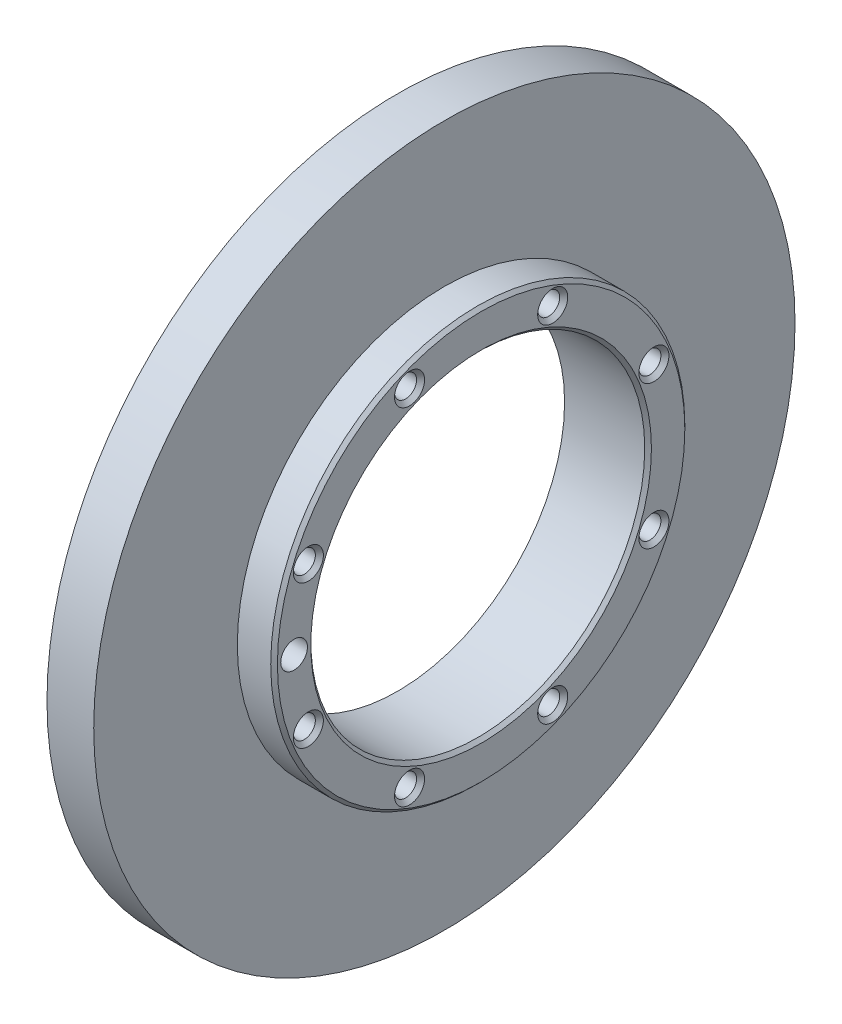
ISO-10303-21;
HEADER;
FILE_DESCRIPTION(('STEP AP214'),'2;1');
FILE_NAME('part.step','',(''),(''),'','','');
FILE_SCHEMA(('AUTOMOTIVE_DESIGN { 1 0 10303 214 1 1 1 1 }'));
ENDSEC;
DATA;
#1=APPLICATION_CONTEXT('core data for automotive mechanical design processes');
#2=APPLICATION_PROTOCOL_DEFINITION('international standard','automotive_design',2000,#1);
#3=PRODUCT_CONTEXT('',#1,'mechanical');
#4=PRODUCT('Part','Part','',(#3));
#5=PRODUCT_RELATED_PRODUCT_CATEGORY('part','',(#4));
#6=PRODUCT_DEFINITION_FORMATION('','',#4);
#7=PRODUCT_DEFINITION_CONTEXT('part definition',#1,'design');
#8=PRODUCT_DEFINITION('design','',#6,#7);
#9=PRODUCT_DEFINITION_SHAPE('','',#8);
#10=(LENGTH_UNIT() NAMED_UNIT(*) SI_UNIT(.MILLI.,.METRE.));
#11=(NAMED_UNIT(*) PLANE_ANGLE_UNIT() SI_UNIT($,.RADIAN.));
#12=(NAMED_UNIT(*) SI_UNIT($,.STERADIAN.) SOLID_ANGLE_UNIT());
#13=UNCERTAINTY_MEASURE_WITH_UNIT(LENGTH_MEASURE(1.E-05),#10,'distance_accuracy_value','');
#14=(GEOMETRIC_REPRESENTATION_CONTEXT(3) GLOBAL_UNCERTAINTY_ASSIGNED_CONTEXT((#13)) GLOBAL_UNIT_ASSIGNED_CONTEXT((#10,
#11,#12)) REPRESENTATION_CONTEXT('',''));
#15=CARTESIAN_POINT('',(0.,0.,0.));
#16=DIRECTION('',(0.,0.,1.));
#17=DIRECTION('',(1.,0.,0.));
#18=AXIS2_PLACEMENT_3D('',#15,#16,#17);
#19=CARTESIAN_POINT('',(889.5,-0.5,1264.));
#20=DIRECTION('',(-1.,0.,0.));
#21=DIRECTION('',(0.,0.,1.));
#22=AXIS2_PLACEMENT_3D('',#19,#20,#21);
#23=PLANE('',#22);
#24=CARTESIAN_POINT('',(889.5,-11.21513610622,1289.86862691));
#25=DIRECTION('',(1.,0.,0.));
#26=DIRECTION('',(0.,0.,-1.));
#27=AXIS2_PLACEMENT_3D('',#24,#25,#26);
#28=CIRCLE('',#27,1.65);
#29=CARTESIAN_POINT('',(889.5,-11.21513610622,1288.21862691));
#30=VERTEX_POINT('',#29);
#31=EDGE_CURVE('E18',#30,#30,#28,.T.);
#32=ORIENTED_EDGE('',*,*,#31,.T.);
#33=EDGE_LOOP('',(#32));
#34=FACE_BOUND('',#33,.T.);
#35=ADVANCED_FACE('F15',(#34),#23,.F.);
#36=CARTESIAN_POINT('',(889.5,-0.5,1264.));
#37=DIRECTION('',(-1.,0.,0.));
#38=DIRECTION('',(0.,0.,1.));
#39=AXIS2_PLACEMENT_3D('',#36,#37,#38);
#40=PLANE('',#39);
#41=CARTESIAN_POINT('',(889.5,-26.36862691032,1274.715136106));
#42=DIRECTION('',(1.,0.,0.));
#43=DIRECTION('',(0.,0.,-1.));
#44=AXIS2_PLACEMENT_3D('',#41,#42,#43);
#45=CIRCLE('',#44,1.65);
#46=CARTESIAN_POINT('',(889.5,-26.36862691032,1273.065136106));
#47=VERTEX_POINT('',#46);
#48=EDGE_CURVE('E94',#47,#47,#45,.T.);
#49=ORIENTED_EDGE('',*,*,#48,.T.);
#50=EDGE_LOOP('',(#49));
#51=FACE_BOUND('',#50,.T.);
#52=ADVANCED_FACE('F228',(#51),#40,.F.);
#53=CARTESIAN_POINT('',(889.5,-0.5,1264.));
#54=DIRECTION('',(-1.,0.,0.));
#55=DIRECTION('',(0.,0.,1.));
#56=AXIS2_PLACEMENT_3D('',#53,#54,#55);
#57=PLANE('',#56);
#58=CARTESIAN_POINT('',(889.5,-26.36862691032,1253.284863894));
#59=DIRECTION('',(1.,0.,0.));
#60=DIRECTION('',(0.,0.,-1.));
#61=AXIS2_PLACEMENT_3D('',#58,#59,#60);
#62=CIRCLE('',#61,1.65);
#63=CARTESIAN_POINT('',(889.5,-26.36862691032,1251.634863894));
#64=VERTEX_POINT('',#63);
#65=EDGE_CURVE('E92',#64,#64,#62,.T.);
#66=ORIENTED_EDGE('',*,*,#65,.T.);
#67=EDGE_LOOP('',(#66));
#68=FACE_BOUND('',#67,.T.);
#69=ADVANCED_FACE('F225',(#68),#57,.F.);
#70=CARTESIAN_POINT('',(889.5,-0.5,1264.));
#71=DIRECTION('',(-1.,0.,0.));
#72=DIRECTION('',(0.,0.,1.));
#73=AXIS2_PLACEMENT_3D('',#70,#71,#72);
#74=PLANE('',#73);
#75=CARTESIAN_POINT('',(889.5,-11.21513610622,1238.13137309));
#76=DIRECTION('',(1.,0.,0.));
#77=DIRECTION('',(0.,0.,-1.));
#78=AXIS2_PLACEMENT_3D('',#75,#76,#77);
#79=CIRCLE('',#78,1.65);
#80=CARTESIAN_POINT('',(889.5,-11.21513610622,1236.48137309));
#81=VERTEX_POINT('',#80);
#82=EDGE_CURVE('E89',#81,#81,#79,.T.);
#83=ORIENTED_EDGE('',*,*,#82,.T.);
#84=EDGE_LOOP('',(#83));
#85=FACE_BOUND('',#84,.T.);
#86=ADVANCED_FACE('F227',(#85),#74,.F.);
#87=CARTESIAN_POINT('',(889.5,-0.5,1264.));
#88=DIRECTION('',(-1.,0.,0.));
#89=DIRECTION('',(0.,0.,1.));
#90=AXIS2_PLACEMENT_3D('',#87,#88,#89);
#91=PLANE('',#90);
#92=CARTESIAN_POINT('',(889.5,10.21513610622,1238.13137309));
#93=DIRECTION('',(1.,0.,0.));
#94=DIRECTION('',(0.,0.,-1.));
#95=AXIS2_PLACEMENT_3D('',#92,#93,#94);
#96=CIRCLE('',#95,1.65);
#97=CARTESIAN_POINT('',(889.5,10.21513610622,1236.48137309));
#98=VERTEX_POINT('',#97);
#99=EDGE_CURVE('E86',#98,#98,#96,.T.);
#100=ORIENTED_EDGE('',*,*,#99,.T.);
#101=EDGE_LOOP('',(#100));
#102=FACE_BOUND('',#101,.T.);
#103=ADVANCED_FACE('F234',(#102),#91,.F.);
#104=CARTESIAN_POINT('',(889.5,-0.5,1264.));
#105=DIRECTION('',(-1.,0.,0.));
#106=DIRECTION('',(0.,0.,1.));
#107=AXIS2_PLACEMENT_3D('',#104,#105,#106);
#108=PLANE('',#107);
#109=CARTESIAN_POINT('',(889.5,25.36862691032,1253.284863894));
#110=DIRECTION('',(1.,0.,0.));
#111=DIRECTION('',(0.,0.,-1.));
#112=AXIS2_PLACEMENT_3D('',#109,#110,#111);
#113=CIRCLE('',#112,1.65);
#114=CARTESIAN_POINT('',(889.5,25.36862691032,1251.634863894));
#115=VERTEX_POINT('',#114);
#116=EDGE_CURVE('E83',#115,#115,#113,.T.);
#117=ORIENTED_EDGE('',*,*,#116,.T.);
#118=EDGE_LOOP('',(#117));
#119=FACE_BOUND('',#118,.T.);
#120=ADVANCED_FACE('F240',(#119),#108,.F.);
#121=CARTESIAN_POINT('',(889.5,-0.5,1264.));
#122=DIRECTION('',(-1.,0.,0.));
#123=DIRECTION('',(0.,0.,1.));
#124=AXIS2_PLACEMENT_3D('',#121,#122,#123);
#125=PLANE('',#124);
#126=CARTESIAN_POINT('',(889.5,25.36862691032,1274.715136106));
#127=DIRECTION('',(1.,0.,0.));
#128=DIRECTION('',(0.,0.,-1.));
#129=AXIS2_PLACEMENT_3D('',#126,#127,#128);
#130=CIRCLE('',#129,1.65);
#131=CARTESIAN_POINT('',(889.5,25.36862691032,1273.065136106));
#132=VERTEX_POINT('',#131);
#133=EDGE_CURVE('E80',#132,#132,#130,.T.);
#134=ORIENTED_EDGE('',*,*,#133,.T.);
#135=EDGE_LOOP('',(#134));
#136=FACE_BOUND('',#135,.T.);
#137=ADVANCED_FACE('F116',(#136),#125,.F.);
#138=CARTESIAN_POINT('',(889.5,-0.5,1264.));
#139=DIRECTION('',(-1.,0.,0.));
#140=DIRECTION('',(0.,0.,1.));
#141=AXIS2_PLACEMENT_3D('',#138,#139,#140);
#142=PLANE('',#141);
#143=CARTESIAN_POINT('',(889.5,10.21513610622,1289.86862691));
#144=DIRECTION('',(1.,0.,0.));
#145=DIRECTION('',(0.,0.,-1.));
#146=AXIS2_PLACEMENT_3D('',#143,#144,#145);
#147=CIRCLE('',#146,1.65);
#148=CARTESIAN_POINT('',(889.5,10.21513610622,1288.21862691));
#149=VERTEX_POINT('',#148);
#150=EDGE_CURVE('E77',#149,#149,#147,.T.);
#151=ORIENTED_EDGE('',*,*,#150,.T.);
#152=EDGE_LOOP('',(#151));
#153=FACE_BOUND('',#152,.T.);
#154=ADVANCED_FACE('F105',(#153),#142,.F.);
#155=CARTESIAN_POINT('',(881.3590089775,-11.21513610622,1289.86862691));
#156=DIRECTION('',(1.,0.,0.));
#157=DIRECTION('',(0.,0.,-1.));
#158=AXIS2_PLACEMENT_3D('',#155,#156,#157);
#159=CYLINDRICAL_SURFACE('',#158,1.65);
#160=CARTESIAN_POINT('',(894.399999999735,-11.21513610622,1289.86862691));
#161=DIRECTION('',(1.,0.,0.));
#162=DIRECTION('',(0.,0.,1.));
#163=AXIS2_PLACEMENT_3D('',#160,#161,#162);
#164=CIRCLE('',#163,1.65000000026039);
#165=CARTESIAN_POINT('',(894.399999999735,-11.21513610622,1291.51862691026));
#166=VERTEX_POINT('',#165);
#167=EDGE_CURVE('E30',#166,#166,#164,.T.);
#168=ORIENTED_EDGE('',*,*,#167,.T.);
#169=EDGE_LOOP('',(#168));
#170=FACE_BOUND('',#169,.T.);
#171=ORIENTED_EDGE('',*,*,#31,.F.);
#172=EDGE_LOOP('',(#171));
#173=FACE_BOUND('',#172,.T.);
#174=ADVANCED_FACE('F102',(#170,#173),#159,.F.);
#175=CARTESIAN_POINT('',(881.3590089775,-26.36862691032,1274.715136106));
#176=DIRECTION('',(1.,0.,0.));
#177=DIRECTION('',(0.,0.,-1.));
#178=AXIS2_PLACEMENT_3D('',#175,#176,#177);
#179=CYLINDRICAL_SURFACE('',#178,1.65);
#180=CARTESIAN_POINT('',(894.399999999735,-26.36862691032,1274.715136106));
#181=DIRECTION('',(1.,0.,0.));
#182=DIRECTION('',(0.,0.,1.));
#183=AXIS2_PLACEMENT_3D('',#180,#181,#182);
#184=CIRCLE('',#183,1.65000000027837);
#185=CARTESIAN_POINT('',(894.399999999735,-26.36862691032,1276.36513610628));
#186=VERTEX_POINT('',#185);
#187=EDGE_CURVE('E460',#186,#186,#184,.T.);
#188=ORIENTED_EDGE('',*,*,#187,.T.);
#189=EDGE_LOOP('',(#188));
#190=FACE_BOUND('',#189,.T.);
#191=ORIENTED_EDGE('',*,*,#48,.F.);
#192=EDGE_LOOP('',(#191));
#193=FACE_BOUND('',#192,.T.);
#194=ADVANCED_FACE('F104',(#190,#193),#179,.F.);
#195=CARTESIAN_POINT('',(881.3590089775,-26.36862691032,1253.284863894));
#196=DIRECTION('',(1.,0.,0.));
#197=DIRECTION('',(0.,0.,-1.));
#198=AXIS2_PLACEMENT_3D('',#195,#196,#197);
#199=CYLINDRICAL_SURFACE('',#198,1.65);
#200=CARTESIAN_POINT('',(894.399999999735,-26.36862691032,1253.284863894));
#201=DIRECTION('',(1.,0.,0.));
#202=DIRECTION('',(0.,0.,1.));
#203=AXIS2_PLACEMENT_3D('',#200,#201,#202);
#204=CIRCLE('',#203,1.65000000022064);
#205=CARTESIAN_POINT('',(894.399999999735,-26.36862691032,1254.93486389422));
#206=VERTEX_POINT('',#205);
#207=EDGE_CURVE('E222',#206,#206,#204,.T.);
#208=ORIENTED_EDGE('',*,*,#207,.T.);
#209=EDGE_LOOP('',(#208));
#210=FACE_BOUND('',#209,.T.);
#211=ORIENTED_EDGE('',*,*,#65,.F.);
#212=EDGE_LOOP('',(#211));
#213=FACE_BOUND('',#212,.T.);
#214=ADVANCED_FACE('F113',(#210,#213),#199,.F.);
#215=CARTESIAN_POINT('',(881.3590089775,-11.21513610622,1238.13137309));
#216=DIRECTION('',(1.,0.,0.));
#217=DIRECTION('',(0.,0.,-1.));
#218=AXIS2_PLACEMENT_3D('',#215,#216,#217);
#219=CYLINDRICAL_SURFACE('',#218,1.65);
#220=CARTESIAN_POINT('',(894.399999999735,-11.21513610622,1238.13137309));
#221=DIRECTION('',(1.,0.,0.));
#222=DIRECTION('',(0.,0.,1.));
#223=AXIS2_PLACEMENT_3D('',#220,#221,#222);
#224=CIRCLE('',#223,1.65000000029547);
#225=CARTESIAN_POINT('',(894.399999999735,-11.21513610622,1239.7813730903));
#226=VERTEX_POINT('',#225);
#227=EDGE_CURVE('E459',#226,#226,#224,.T.);
#228=ORIENTED_EDGE('',*,*,#227,.T.);
#229=EDGE_LOOP('',(#228));
#230=FACE_BOUND('',#229,.T.);
#231=ORIENTED_EDGE('',*,*,#82,.F.);
#232=EDGE_LOOP('',(#231));
#233=FACE_BOUND('',#232,.T.);
#234=ADVANCED_FACE('F210',(#230,#233),#219,.F.);
#235=CARTESIAN_POINT('',(881.3590089775,10.21513610622,1238.13137309));
#236=DIRECTION('',(1.,0.,0.));
#237=DIRECTION('',(0.,0.,-1.));
#238=AXIS2_PLACEMENT_3D('',#235,#236,#237);
#239=CYLINDRICAL_SURFACE('',#238,1.65);
#240=CARTESIAN_POINT('',(894.399999999735,10.21513610622,1238.13137309));
#241=DIRECTION('',(1.,0.,0.));
#242=DIRECTION('',(0.,0.,1.));
#243=AXIS2_PLACEMENT_3D('',#240,#241,#242);
#244=CIRCLE('',#243,1.65000000029547);
#245=CARTESIAN_POINT('',(894.399999999735,10.21513610622,1239.7813730903));
#246=VERTEX_POINT('',#245);
#247=EDGE_CURVE('E463',#246,#246,#244,.T.);
#248=ORIENTED_EDGE('',*,*,#247,.T.);
#249=EDGE_LOOP('',(#248));
#250=FACE_BOUND('',#249,.T.);
#251=ORIENTED_EDGE('',*,*,#99,.F.);
#252=EDGE_LOOP('',(#251));
#253=FACE_BOUND('',#252,.T.);
#254=ADVANCED_FACE('F206',(#250,#253),#239,.F.);
#255=CARTESIAN_POINT('',(881.3590089775,25.36862691032,1253.284863894));
#256=DIRECTION('',(1.,0.,0.));
#257=DIRECTION('',(0.,0.,-1.));
#258=AXIS2_PLACEMENT_3D('',#255,#256,#257);
#259=CYLINDRICAL_SURFACE('',#258,1.65);
#260=CARTESIAN_POINT('',(894.399999999735,25.36862691032,1253.284863894));
#261=DIRECTION('',(1.,0.,0.));
#262=DIRECTION('',(0.,0.,1.));
#263=AXIS2_PLACEMENT_3D('',#260,#261,#262);
#264=CIRCLE('',#263,1.65000000022064);
#265=CARTESIAN_POINT('',(894.399999999735,25.36862691032,1254.93486389422));
#266=VERTEX_POINT('',#265);
#267=EDGE_CURVE('E469',#266,#266,#264,.T.);
#268=ORIENTED_EDGE('',*,*,#267,.T.);
#269=EDGE_LOOP('',(#268));
#270=FACE_BOUND('',#269,.T.);
#271=ORIENTED_EDGE('',*,*,#116,.F.);
#272=EDGE_LOOP('',(#271));
#273=FACE_BOUND('',#272,.T.);
#274=ADVANCED_FACE('F202',(#270,#273),#259,.F.);
#275=CARTESIAN_POINT('',(881.3590089775,25.36862691032,1274.715136106));
#276=DIRECTION('',(1.,0.,0.));
#277=DIRECTION('',(0.,0.,-1.));
#278=AXIS2_PLACEMENT_3D('',#275,#276,#277);
#279=CYLINDRICAL_SURFACE('',#278,1.65);
#280=CARTESIAN_POINT('',(894.399999999735,25.36862691032,1274.715136106));
#281=DIRECTION('',(1.,0.,0.));
#282=DIRECTION('',(0.,0.,1.));
#283=AXIS2_PLACEMENT_3D('',#280,#281,#282);
#284=CIRCLE('',#283,1.65000000027837);
#285=CARTESIAN_POINT('',(894.399999999735,25.36862691032,1276.36513610628));
#286=VERTEX_POINT('',#285);
#287=EDGE_CURVE('E472',#286,#286,#284,.T.);
#288=ORIENTED_EDGE('',*,*,#287,.T.);
#289=EDGE_LOOP('',(#288));
#290=FACE_BOUND('',#289,.T.);
#291=ORIENTED_EDGE('',*,*,#133,.F.);
#292=EDGE_LOOP('',(#291));
#293=FACE_BOUND('',#292,.T.);
#294=ADVANCED_FACE('F198',(#290,#293),#279,.F.);
#295=CARTESIAN_POINT('',(881.3590089775,10.21513610622,1289.86862691));
#296=DIRECTION('',(1.,0.,0.));
#297=DIRECTION('',(0.,0.,-1.));
#298=AXIS2_PLACEMENT_3D('',#295,#296,#297);
#299=CYLINDRICAL_SURFACE('',#298,1.65);
#300=CARTESIAN_POINT('',(894.399999999735,10.21513610622,1289.86862691));
#301=DIRECTION('',(1.,0.,0.));
#302=DIRECTION('',(0.,0.,1.));
#303=AXIS2_PLACEMENT_3D('',#300,#301,#302);
#304=CIRCLE('',#303,1.65000000026039);
#305=CARTESIAN_POINT('',(894.399999999735,10.21513610622,1291.51862691026));
#306=VERTEX_POINT('',#305);
#307=EDGE_CURVE('E76',#306,#306,#304,.T.);
#308=ORIENTED_EDGE('',*,*,#307,.T.);
#309=EDGE_LOOP('',(#308));
#310=FACE_BOUND('',#309,.T.);
#311=ORIENTED_EDGE('',*,*,#150,.F.);
#312=EDGE_LOOP('',(#311));
#313=FACE_BOUND('',#312,.T.);
#314=ADVANCED_FACE('F194',(#310,#313),#299,.F.);
#315=CARTESIAN_POINT('',(889.5,-0.5,1264.));
#316=DIRECTION('',(-1.,0.,0.));
#317=DIRECTION('',(0.,0.,1.));
#318=AXIS2_PLACEMENT_3D('',#315,#316,#317);
#319=PLANE('',#318);
#320=CARTESIAN_POINT('',(889.5,-0.5,1292.));
#321=DIRECTION('',(-1.,0.,0.));
#322=DIRECTION('',(0.,0.,1.));
#323=AXIS2_PLACEMENT_3D('',#320,#321,#322);
#324=CIRCLE('',#323,2.);
#325=CARTESIAN_POINT('',(889.5,-0.5,1294.));
#326=VERTEX_POINT('',#325);
#327=EDGE_CURVE('E73',#326,#326,#324,.F.);
#328=ORIENTED_EDGE('',*,*,#327,.T.);
#329=EDGE_LOOP('',(#328));
#330=FACE_BOUND('',#329,.T.);
#331=ADVANCED_FACE('F190',(#330),#319,.F.);
#332=CARTESIAN_POINT('',(894.499999999769,-0.5,1264.));
#333=DIRECTION('',(-1.,0.,0.));
#334=DIRECTION('',(0.,0.,1.));
#335=AXIS2_PLACEMENT_3D('',#332,#333,#334);
#336=CONICAL_SURFACE('',#335,30.999999999772,0.785398162500159);
#337=CARTESIAN_POINT('',(894.500000000003,-0.5,1264.));
#338=DIRECTION('',(1.,0.,0.));
#339=DIRECTION('',(0.,0.,-1.));
#340=AXIS2_PLACEMENT_3D('',#337,#338,#339);
#341=CIRCLE('',#340,31.);
#342=CARTESIAN_POINT('',(894.500000000005,-0.5,1233.));
#343=VERTEX_POINT('',#342);
#344=EDGE_CURVE('E72',#343,#343,#341,.F.);
#345=ORIENTED_EDGE('',*,*,#344,.F.);
#346=EDGE_LOOP('',(#345));
#347=FACE_BOUND('',#346,.T.);
#348=CARTESIAN_POINT('',(895.000000000221,-0.500000000000001,1264.));
#349=DIRECTION('',(-1.,0.,0.));
#350=DIRECTION('',(0.,0.,1.));
#351=AXIS2_PLACEMENT_3D('',#348,#349,#350);
#352=CIRCLE('',#351,30.500000000218);
#353=CARTESIAN_POINT('',(895.000000000218,-0.500000000000001,1294.50000000022));
#354=VERTEX_POINT('',#353);
#355=EDGE_CURVE('E69',#354,#354,#352,.F.);
#356=ORIENTED_EDGE('',*,*,#355,.F.);
#357=EDGE_LOOP('',(#356));
#358=FACE_BOUND('',#357,.T.);
#359=ADVANCED_FACE('F186',(#347,#358),#336,.T.);
#360=CARTESIAN_POINT('',(895.00000000038,-11.21513610622,1289.86862691));
#361=DIRECTION('',(1.,0.,0.));
#362=DIRECTION('',(0.,0.,-1.));
#363=AXIS2_PLACEMENT_3D('',#360,#361,#362);
#364=CONICAL_SURFACE('',#363,2.24999999982556,0.785398162497335);
#365=ORIENTED_EDGE('',*,*,#167,.F.);
#366=EDGE_LOOP('',(#365));
#367=FACE_BOUND('',#366,.T.);
#368=CARTESIAN_POINT('',(895.00000000021,-11.21513610622,1289.86862691));
#369=DIRECTION('',(1.,0.,0.));
#370=DIRECTION('',(0.,0.,-1.));
#371=AXIS2_PLACEMENT_3D('',#368,#369,#370);
#372=CIRCLE('',#371,2.24999999965519);
#373=CARTESIAN_POINT('',(895.00000000021,-11.21513610622,1287.61862691034));
#374=VERTEX_POINT('',#373);
#375=EDGE_CURVE('E66',#374,#374,#372,.F.);
#376=ORIENTED_EDGE('',*,*,#375,.F.);
#377=EDGE_LOOP('',(#376));
#378=FACE_BOUND('',#377,.T.);
#379=ADVANCED_FACE('F182',(#367,#378),#364,.F.);
#380=CARTESIAN_POINT('',(895.00000000038,-26.36862691032,1274.715136106));
#381=DIRECTION('',(1.,0.,0.));
#382=DIRECTION('',(0.,0.,-1.));
#383=AXIS2_PLACEMENT_3D('',#380,#381,#382);
#384=CONICAL_SURFACE('',#383,2.24999999984354,0.785398162497335);
#385=ORIENTED_EDGE('',*,*,#187,.F.);
#386=EDGE_LOOP('',(#385));
#387=FACE_BOUND('',#386,.T.);
#388=CARTESIAN_POINT('',(895.000000000323,-26.36862691032,1274.715136106));
#389=DIRECTION('',(1.,0.,0.));
#390=DIRECTION('',(0.,0.,-1.));
#391=AXIS2_PLACEMENT_3D('',#388,#389,#390);
#392=CIRCLE('',#391,2.24999999978687);
#393=CARTESIAN_POINT('',(895.000000000323,-26.36862691032,1272.46513610621));
#394=VERTEX_POINT('',#393);
#395=EDGE_CURVE('E63',#394,#394,#392,.F.);
#396=ORIENTED_EDGE('',*,*,#395,.F.);
#397=EDGE_LOOP('',(#396));
#398=FACE_BOUND('',#397,.T.);
#399=ADVANCED_FACE('F178',(#387,#398),#384,.F.);
#400=CARTESIAN_POINT('',(895.000000000266,-26.36862691032,1253.284863894));
#401=DIRECTION('',(1.,0.,0.));
#402=DIRECTION('',(0.,0.,-1.));
#403=AXIS2_PLACEMENT_3D('',#400,#401,#402);
#404=CONICAL_SURFACE('',#403,2.24999999972897,0.785398162544705);
#405=ORIENTED_EDGE('',*,*,#207,.F.);
#406=EDGE_LOOP('',(#405));
#407=FACE_BOUND('',#406,.T.);
#408=CARTESIAN_POINT('',(895.00000000021,-26.36862691032,1253.284863894));
#409=DIRECTION('',(1.,0.,0.));
#410=DIRECTION('',(0.,0.,-1.));
#411=AXIS2_PLACEMENT_3D('',#408,#409,#410);
#412=CIRCLE('',#411,2.24999999967235);
#413=CARTESIAN_POINT('',(895.00000000021,-26.36862691032,1251.03486389433));
#414=VERTEX_POINT('',#413);
#415=EDGE_CURVE('E60',#414,#414,#412,.F.);
#416=ORIENTED_EDGE('',*,*,#415,.F.);
#417=EDGE_LOOP('',(#416));
#418=FACE_BOUND('',#417,.T.);
#419=ADVANCED_FACE('F174',(#407,#418),#404,.F.);
#420=CARTESIAN_POINT('',(895.000000000323,-11.21513610622,1238.13137309));
#421=DIRECTION('',(1.,0.,0.));
#422=DIRECTION('',(0.,0.,-1.));
#423=AXIS2_PLACEMENT_3D('',#420,#421,#422);
#424=CONICAL_SURFACE('',#423,2.2499999998038,0.785398162497335);
#425=ORIENTED_EDGE('',*,*,#227,.F.);
#426=EDGE_LOOP('',(#425));
#427=FACE_BOUND('',#426,.T.);
#428=CARTESIAN_POINT('',(895.000000000266,-11.21513610622,1238.13137309));
#429=DIRECTION('',(1.,0.,0.));
#430=DIRECTION('',(0.,0.,-1.));
#431=AXIS2_PLACEMENT_3D('',#428,#429,#430);
#432=CIRCLE('',#431,2.24999999974712);
#433=CARTESIAN_POINT('',(895.000000000266,-11.21513610622,1235.88137309025));
#434=VERTEX_POINT('',#433);
#435=EDGE_CURVE('E57',#434,#434,#432,.F.);
#436=ORIENTED_EDGE('',*,*,#435,.F.);
#437=EDGE_LOOP('',(#436));
#438=FACE_BOUND('',#437,.T.);
#439=ADVANCED_FACE('F170',(#427,#438),#424,.F.);
#440=CARTESIAN_POINT('',(895.000000000323,10.21513610622,1238.13137309));
#441=DIRECTION('',(1.,0.,0.));
#442=DIRECTION('',(0.,0.,-1.));
#443=AXIS2_PLACEMENT_3D('',#440,#441,#442);
#444=CONICAL_SURFACE('',#443,2.2499999998038,0.785398162497335);
#445=ORIENTED_EDGE('',*,*,#247,.F.);
#446=EDGE_LOOP('',(#445));
#447=FACE_BOUND('',#446,.T.);
#448=CARTESIAN_POINT('',(895.000000000266,10.21513610622,1238.13137309));
#449=DIRECTION('',(1.,0.,0.));
#450=DIRECTION('',(0.,0.,-1.));
#451=AXIS2_PLACEMENT_3D('',#448,#449,#450);
#452=CIRCLE('',#451,2.24999999974712);
#453=CARTESIAN_POINT('',(895.000000000266,10.21513610622,1235.88137309025));
#454=VERTEX_POINT('',#453);
#455=EDGE_CURVE('E54',#454,#454,#452,.F.);
#456=ORIENTED_EDGE('',*,*,#455,.F.);
#457=EDGE_LOOP('',(#456));
#458=FACE_BOUND('',#457,.T.);
#459=ADVANCED_FACE('F166',(#447,#458),#444,.F.);
#460=CARTESIAN_POINT('',(895.000000000266,25.36862691032,1253.284863894));
#461=DIRECTION('',(1.,0.,0.));
#462=DIRECTION('',(0.,0.,-1.));
#463=AXIS2_PLACEMENT_3D('',#460,#461,#462);
#464=CONICAL_SURFACE('',#463,2.24999999972897,0.785398162544705);
#465=ORIENTED_EDGE('',*,*,#267,.F.);
#466=EDGE_LOOP('',(#465));
#467=FACE_BOUND('',#466,.T.);
#468=CARTESIAN_POINT('',(895.00000000021,25.36862691032,1253.284863894));
#469=DIRECTION('',(1.,0.,0.));
#470=DIRECTION('',(0.,0.,-1.));
#471=AXIS2_PLACEMENT_3D('',#468,#469,#470);
#472=CIRCLE('',#471,2.24999999967235);
#473=CARTESIAN_POINT('',(895.00000000021,25.36862691032,1251.03486389433));
#474=VERTEX_POINT('',#473);
#475=EDGE_CURVE('E51',#474,#474,#472,.F.);
#476=ORIENTED_EDGE('',*,*,#475,.F.);
#477=EDGE_LOOP('',(#476));
#478=FACE_BOUND('',#477,.T.);
#479=ADVANCED_FACE('F162',(#467,#478),#464,.F.);
#480=CARTESIAN_POINT('',(895.00000000038,25.36862691032,1274.715136106));
#481=DIRECTION('',(1.,0.,0.));
#482=DIRECTION('',(0.,0.,-1.));
#483=AXIS2_PLACEMENT_3D('',#480,#481,#482);
#484=CONICAL_SURFACE('',#483,2.24999999984354,0.785398162497335);
#485=ORIENTED_EDGE('',*,*,#287,.F.);
#486=EDGE_LOOP('',(#485));
#487=FACE_BOUND('',#486,.T.);
#488=CARTESIAN_POINT('',(895.000000000323,25.36862691032,1274.715136106));
#489=DIRECTION('',(1.,0.,0.));
#490=DIRECTION('',(0.,0.,-1.));
#491=AXIS2_PLACEMENT_3D('',#488,#489,#490);
#492=CIRCLE('',#491,2.24999999978687);
#493=CARTESIAN_POINT('',(895.000000000323,25.36862691032,1272.46513610621));
#494=VERTEX_POINT('',#493);
#495=EDGE_CURVE('E48',#494,#494,#492,.F.);
#496=ORIENTED_EDGE('',*,*,#495,.F.);
#497=EDGE_LOOP('',(#496));
#498=FACE_BOUND('',#497,.T.);
#499=ADVANCED_FACE('F158',(#487,#498),#484,.F.);
#500=CARTESIAN_POINT('',(895.00000000038,10.21513610622,1289.86862691));
#501=DIRECTION('',(1.,0.,0.));
#502=DIRECTION('',(0.,0.,-1.));
#503=AXIS2_PLACEMENT_3D('',#500,#501,#502);
#504=CONICAL_SURFACE('',#503,2.24999999982556,0.785398162497335);
#505=ORIENTED_EDGE('',*,*,#307,.F.);
#506=EDGE_LOOP('',(#505));
#507=FACE_BOUND('',#506,.T.);
#508=CARTESIAN_POINT('',(895.00000000021,10.21513610622,1289.86862691));
#509=DIRECTION('',(1.,0.,0.));
#510=DIRECTION('',(0.,0.,-1.));
#511=AXIS2_PLACEMENT_3D('',#508,#509,#510);
#512=CIRCLE('',#511,2.24999999965519);
#513=CARTESIAN_POINT('',(895.00000000021,10.21513610622,1287.61862691034));
#514=VERTEX_POINT('',#513);
#515=EDGE_CURVE('E45',#514,#514,#512,.F.);
#516=ORIENTED_EDGE('',*,*,#515,.F.);
#517=EDGE_LOOP('',(#516));
#518=FACE_BOUND('',#517,.T.);
#519=ADVANCED_FACE('F154',(#507,#518),#504,.F.);
#520=CARTESIAN_POINT('',(895.,-0.5,1292.));
#521=DIRECTION('',(-1.,0.,0.));
#522=DIRECTION('',(0.,0.,1.));
#523=AXIS2_PLACEMENT_3D('',#520,#521,#522);
#524=CYLINDRICAL_SURFACE('',#523,2.);
#525=CARTESIAN_POINT('',(895.,-0.5,1292.));
#526=DIRECTION('',(-1.,0.,0.));
#527=DIRECTION('',(0.,0.,1.));
#528=AXIS2_PLACEMENT_3D('',#525,#526,#527);
#529=CIRCLE('',#528,2.);
#530=CARTESIAN_POINT('',(895.,-0.5,1294.));
#531=VERTEX_POINT('',#530);
#532=EDGE_CURVE('E42',#531,#531,#529,.T.);
#533=ORIENTED_EDGE('',*,*,#532,.F.);
#534=EDGE_LOOP('',(#533));
#535=FACE_BOUND('',#534,.T.);
#536=ORIENTED_EDGE('',*,*,#327,.F.);
#537=EDGE_LOOP('',(#536));
#538=FACE_BOUND('',#537,.T.);
#539=ADVANCED_FACE('F150',(#535,#538),#524,.F.);
#540=CARTESIAN_POINT('',(877.675,-0.5,1264.));
#541=DIRECTION('',(1.,0.,0.));
#542=DIRECTION('',(0.,0.,-1.));
#543=AXIS2_PLACEMENT_3D('',#540,#541,#542);
#544=CYLINDRICAL_SURFACE('',#543,31.);
#545=ORIENTED_EDGE('',*,*,#344,.T.);
#546=EDGE_LOOP('',(#545));
#547=FACE_BOUND('',#546,.T.);
#548=CARTESIAN_POINT('',(889.499999999997,-0.5,1264.));
#549=DIRECTION('',(1.,0.,0.));
#550=DIRECTION('',(0.,0.,-1.));
#551=AXIS2_PLACEMENT_3D('',#548,#549,#550);
#552=CIRCLE('',#551,31.);
#553=CARTESIAN_POINT('',(889.5,-0.5,1233.));
#554=VERTEX_POINT('',#553);
#555=EDGE_CURVE('E39',#554,#554,#552,.T.);
#556=ORIENTED_EDGE('',*,*,#555,.T.);
#557=EDGE_LOOP('',(#556));
#558=FACE_BOUND('',#557,.T.);
#559=ADVANCED_FACE('F146',(#547,#558),#544,.T.);
#560=CARTESIAN_POINT('',(895.,-0.5,1264.));
#561=DIRECTION('',(1.,0.,0.));
#562=DIRECTION('',(0.,0.,-1.));
#563=AXIS2_PLACEMENT_3D('',#560,#561,#562);
#564=PLANE('',#563);
#565=ORIENTED_EDGE('',*,*,#532,.T.);
#566=EDGE_LOOP('',(#565));
#567=FACE_BOUND('',#566,.T.);
#568=ORIENTED_EDGE('',*,*,#515,.T.);
#569=EDGE_LOOP('',(#568));
#570=FACE_BOUND('',#569,.T.);
#571=ORIENTED_EDGE('',*,*,#495,.T.);
#572=EDGE_LOOP('',(#571));
#573=FACE_BOUND('',#572,.T.);
#574=ORIENTED_EDGE('',*,*,#475,.T.);
#575=EDGE_LOOP('',(#574));
#576=FACE_BOUND('',#575,.T.);
#577=ORIENTED_EDGE('',*,*,#455,.T.);
#578=EDGE_LOOP('',(#577));
#579=FACE_BOUND('',#578,.T.);
#580=ORIENTED_EDGE('',*,*,#435,.T.);
#581=EDGE_LOOP('',(#580));
#582=FACE_BOUND('',#581,.T.);
#583=ORIENTED_EDGE('',*,*,#415,.T.);
#584=EDGE_LOOP('',(#583));
#585=FACE_BOUND('',#584,.T.);
#586=ORIENTED_EDGE('',*,*,#395,.T.);
#587=EDGE_LOOP('',(#586));
#588=FACE_BOUND('',#587,.T.);
#589=ORIENTED_EDGE('',*,*,#375,.T.);
#590=EDGE_LOOP('',(#589));
#591=FACE_BOUND('',#590,.T.);
#592=CARTESIAN_POINT('',(895.000000000195,-0.5,1264.));
#593=DIRECTION('',(1.,0.,0.));
#594=DIRECTION('',(0.,0.,-1.));
#595=AXIS2_PLACEMENT_3D('',#592,#593,#594);
#596=CIRCLE('',#595,25.4999999998057);
#597=CARTESIAN_POINT('',(895.000000000197,-0.5,1238.50000000019));
#598=VERTEX_POINT('',#597);
#599=EDGE_CURVE('E36',#598,#598,#596,.F.);
#600=ORIENTED_EDGE('',*,*,#599,.T.);
#601=EDGE_LOOP('',(#600));
#602=FACE_BOUND('',#601,.T.);
#603=ORIENTED_EDGE('',*,*,#355,.T.);
#604=EDGE_LOOP('',(#603));
#605=FACE_BOUND('',#604,.T.);
#606=ADVANCED_FACE('F142',(#567,#570,#573,#576,#579,#582,#585,#588,#591,#602,#605),#564,.T.);
#607=CARTESIAN_POINT('',(889.5,-0.5,1264.));
#608=DIRECTION('',(-1.,0.,0.));
#609=DIRECTION('',(0.,0.,1.));
#610=AXIS2_PLACEMENT_3D('',#607,#608,#609);
#611=PLANE('',#610);
#612=ORIENTED_EDGE('',*,*,#555,.F.);
#613=EDGE_LOOP('',(#612));
#614=FACE_BOUND('',#613,.T.);
#615=CARTESIAN_POINT('',(889.500000000005,-0.5,1264.));
#616=DIRECTION('',(-1.,0.,0.));
#617=DIRECTION('',(0.,0.,1.));
#618=AXIS2_PLACEMENT_3D('',#615,#616,#617);
#619=CIRCLE('',#618,52.5);
#620=CARTESIAN_POINT('',(889.5,-0.5,1316.5));
#621=VERTEX_POINT('',#620);
#622=EDGE_CURVE('E33',#621,#621,#619,.T.);
#623=ORIENTED_EDGE('',*,*,#622,.F.);
#624=EDGE_LOOP('',(#623));
#625=FACE_BOUND('',#624,.T.);
#626=ADVANCED_FACE('F138',(#614,#625),#611,.F.);
#627=CARTESIAN_POINT('',(895.000000000193,-0.5,1264.));
#628=DIRECTION('',(1.,0.,0.));
#629=DIRECTION('',(0.,0.,-1.));
#630=AXIS2_PLACEMENT_3D('',#627,#628,#629);
#631=CONICAL_SURFACE('',#630,25.4999999998046,0.785398162499913);
#632=CARTESIAN_POINT('',(894.499999999998,-0.5,1264.));
#633=DIRECTION('',(1.,0.,0.));
#634=DIRECTION('',(0.,0.,-1.));
#635=AXIS2_PLACEMENT_3D('',#632,#633,#634);
#636=CIRCLE('',#635,25.);
#637=CARTESIAN_POINT('',(894.5,-0.5,1239.));
#638=VERTEX_POINT('',#637);
#639=EDGE_CURVE('E27',#638,#638,#636,.F.);
#640=ORIENTED_EDGE('',*,*,#639,.T.);
#641=EDGE_LOOP('',(#640));
#642=FACE_BOUND('',#641,.T.);
#643=ORIENTED_EDGE('',*,*,#599,.F.);
#644=EDGE_LOOP('',(#643));
#645=FACE_BOUND('',#644,.T.);
#646=ADVANCED_FACE('F134',(#642,#645),#631,.F.);
#647=CARTESIAN_POINT('',(882.5,-0.5,1264.));
#648=DIRECTION('',(-1.,0.,0.));
#649=DIRECTION('',(0.,0.,1.));
#650=AXIS2_PLACEMENT_3D('',#647,#648,#649);
#651=CYLINDRICAL_SURFACE('',#650,52.5);
#652=ORIENTED_EDGE('',*,*,#622,.T.);
#653=EDGE_LOOP('',(#652));
#654=FACE_BOUND('',#653,.T.);
#655=CARTESIAN_POINT('',(882.500000000005,-0.5,1264.));
#656=DIRECTION('',(-1.,0.,0.));
#657=DIRECTION('',(0.,0.,1.));
#658=AXIS2_PLACEMENT_3D('',#655,#656,#657);
#659=CIRCLE('',#658,52.5);
#660=CARTESIAN_POINT('',(882.5,-0.5,1316.5));
#661=VERTEX_POINT('',#660);
#662=EDGE_CURVE('E22',#661,#661,#659,.T.);
#663=ORIENTED_EDGE('',*,*,#662,.F.);
#664=EDGE_LOOP('',(#663));
#665=FACE_BOUND('',#664,.T.);
#666=ADVANCED_FACE('F127',(#654,#665),#651,.T.);
#667=CARTESIAN_POINT('',(868.225,-0.5,1264.));
#668=DIRECTION('',(1.,0.,0.));
#669=DIRECTION('',(0.,0.,-1.));
#670=AXIS2_PLACEMENT_3D('',#667,#668,#669);
#671=CYLINDRICAL_SURFACE('',#670,25.);
#672=CARTESIAN_POINT('',(882.5,-0.5,1264.));
#673=DIRECTION('',(1.,0.,0.));
#674=DIRECTION('',(0.,0.,-1.));
#675=AXIS2_PLACEMENT_3D('',#672,#673,#674);
#676=CIRCLE('',#675,25.);
#677=CARTESIAN_POINT('',(882.500000000002,-0.5,1239.));
#678=VERTEX_POINT('',#677);
#679=EDGE_CURVE('E10',#678,#678,#676,.T.);
#680=ORIENTED_EDGE('',*,*,#679,.F.);
#681=EDGE_LOOP('',(#680));
#682=FACE_BOUND('',#681,.T.);
#683=ORIENTED_EDGE('',*,*,#639,.F.);
#684=EDGE_LOOP('',(#683));
#685=FACE_BOUND('',#684,.T.);
#686=ADVANCED_FACE('F122',(#682,#685),#671,.F.);
#687=CARTESIAN_POINT('',(882.5,-0.5,1264.));
#688=DIRECTION('',(-1.,0.,0.));
#689=DIRECTION('',(0.,0.,1.));
#690=AXIS2_PLACEMENT_3D('',#687,#688,#689);
#691=PLANE('',#690);
#692=ORIENTED_EDGE('',*,*,#679,.T.);
#693=EDGE_LOOP('',(#692));
#694=FACE_BOUND('',#693,.T.);
#695=ORIENTED_EDGE('',*,*,#662,.T.);
#696=EDGE_LOOP('',(#695));
#697=FACE_BOUND('',#696,.T.);
#698=ADVANCED_FACE('F120',(#694,#697),#691,.T.);
#699=CLOSED_SHELL('',(#35,#52,#69,#86,#103,#120,#137,#154,#174,#194,#214,#234,#254,#274,#294,
#314,#331,#359,#379,#399,#419,#439,#459,#479,#499,#519,#539,#559,#606,#626,#646,#666,#686,#698));
#700=MANIFOLD_SOLID_BREP('B1',#699);
#701=ADVANCED_BREP_SHAPE_REPRESENTATION('',(#18,#700),#14);
#702=SHAPE_DEFINITION_REPRESENTATION(#9,#701);
ENDSEC;
END-ISO-10303-21;
